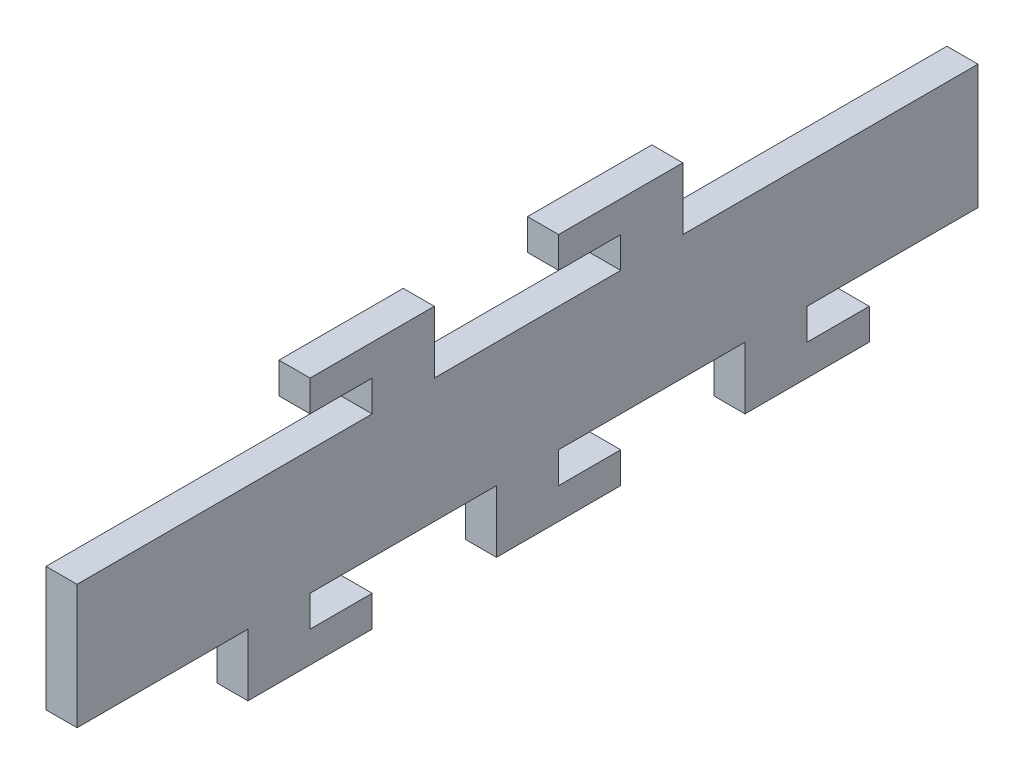
ISO-10303-21;
HEADER;
FILE_DESCRIPTION(('STEP AP214'),'2;1');
FILE_NAME('part.step','',(''),(''),'','','');
FILE_SCHEMA(('AUTOMOTIVE_DESIGN { 1 0 10303 214 1 1 1 1 }'));
ENDSEC;
DATA;
#1=APPLICATION_CONTEXT('core data for automotive mechanical design processes');
#2=APPLICATION_PROTOCOL_DEFINITION('international standard','automotive_design',2000,#1);
#3=PRODUCT_CONTEXT('',#1,'mechanical');
#4=PRODUCT('Part','Part','',(#3));
#5=PRODUCT_RELATED_PRODUCT_CATEGORY('part','',(#4));
#6=PRODUCT_DEFINITION_FORMATION('','',#4);
#7=PRODUCT_DEFINITION_CONTEXT('part definition',#1,'design');
#8=PRODUCT_DEFINITION('design','',#6,#7);
#9=PRODUCT_DEFINITION_SHAPE('','',#8);
#10=(LENGTH_UNIT() NAMED_UNIT(*) SI_UNIT(.MILLI.,.METRE.));
#11=(NAMED_UNIT(*) PLANE_ANGLE_UNIT() SI_UNIT($,.RADIAN.));
#12=(NAMED_UNIT(*) SI_UNIT($,.STERADIAN.) SOLID_ANGLE_UNIT());
#13=UNCERTAINTY_MEASURE_WITH_UNIT(LENGTH_MEASURE(1.E-05),#10,'distance_accuracy_value','');
#14=(GEOMETRIC_REPRESENTATION_CONTEXT(3) GLOBAL_UNCERTAINTY_ASSIGNED_CONTEXT((#13)) GLOBAL_UNIT_ASSIGNED_CONTEXT((#10,
#11,#12)) REPRESENTATION_CONTEXT('',''));
#15=CARTESIAN_POINT('',(0.,0.,0.));
#16=DIRECTION('',(0.,0.,1.));
#17=DIRECTION('',(1.,0.,0.));
#18=AXIS2_PLACEMENT_3D('',#15,#16,#17);
#19=CARTESIAN_POINT('',(5.,10.,72.5));
#20=DIRECTION('',(0.,-1.,0.));
#21=DIRECTION('',(0.,0.,-1.));
#22=AXIS2_PLACEMENT_3D('',#19,#20,#21);
#23=PLANE('',#22);
#24=DIRECTION('',(0.,0.,1.));
#25=VECTOR('',#24,1.);
#26=CARTESIAN_POINT('',(0.,10.,72.5));
#27=LINE('',#26,#25);
#28=CARTESIAN_POINT('',(0.,10.,25.));
#29=VERTEX_POINT('',#28);
#30=CARTESIAN_POINT('',(0.,10.,72.5));
#31=VERTEX_POINT('',#30);
#32=EDGE_CURVE('E285',#29,#31,#27,.T.);
#33=ORIENTED_EDGE('',*,*,#32,.T.);
#34=DIRECTION('',(-1.,0.,0.));
#35=VECTOR('',#34,1.);
#36=CARTESIAN_POINT('',(5.,10.,72.5));
#37=LINE('',#36,#35);
#38=CARTESIAN_POINT('',(5.,10.,72.5));
#39=VERTEX_POINT('',#38);
#40=EDGE_CURVE('E11',#39,#31,#37,.T.);
#41=ORIENTED_EDGE('',*,*,#40,.F.);
#42=DIRECTION('',(0.,0.,1.));
#43=VECTOR('',#42,1.);
#44=CARTESIAN_POINT('',(5.,10.,72.5));
#45=LINE('',#44,#43);
#46=CARTESIAN_POINT('',(5.,10.,25.));
#47=VERTEX_POINT('',#46);
#48=EDGE_CURVE('E351',#47,#39,#45,.T.);
#49=ORIENTED_EDGE('',*,*,#48,.F.);
#50=DIRECTION('',(-1.,0.,0.));
#51=VECTOR('',#50,1.);
#52=CARTESIAN_POINT('',(5.,10.,25.));
#53=LINE('',#52,#51);
#54=EDGE_CURVE('E281',#47,#29,#53,.T.);
#55=ORIENTED_EDGE('',*,*,#54,.T.);
#56=EDGE_LOOP('',(#33,#41,#49,#55));
#57=FACE_BOUND('',#56,.T.);
#58=ADVANCED_FACE('F33',(#57),#23,.F.);
#59=CARTESIAN_POINT('',(5.,10.,72.5));
#60=DIRECTION('',(0.,0.,-1.));
#61=DIRECTION('',(0.,1.,0.));
#62=AXIS2_PLACEMENT_3D('',#59,#60,#61);
#63=PLANE('',#62);
#64=DIRECTION('',(0.,-1.,0.));
#65=VECTOR('',#64,1.);
#66=CARTESIAN_POINT('',(0.,10.,72.5));
#67=LINE('',#66,#65);
#68=CARTESIAN_POINT('',(0.,-10.,72.5));
#69=VERTEX_POINT('',#68);
#70=EDGE_CURVE('E288',#31,#69,#67,.T.);
#71=ORIENTED_EDGE('',*,*,#70,.T.);
#72=DIRECTION('',(-1.,0.,0.));
#73=VECTOR('',#72,1.);
#74=CARTESIAN_POINT('',(5.,-10.,72.5));
#75=LINE('',#74,#73);
#76=CARTESIAN_POINT('',(5.,-10.,72.5));
#77=VERTEX_POINT('',#76);
#78=EDGE_CURVE('E41',#77,#69,#75,.T.);
#79=ORIENTED_EDGE('',*,*,#78,.F.);
#80=DIRECTION('',(0.,-1.,0.));
#81=VECTOR('',#80,1.);
#82=CARTESIAN_POINT('',(5.,10.,72.5));
#83=LINE('',#82,#81);
#84=EDGE_CURVE('E170',#39,#77,#83,.T.);
#85=ORIENTED_EDGE('',*,*,#84,.F.);
#86=ORIENTED_EDGE('',*,*,#40,.T.);
#87=EDGE_LOOP('',(#71,#79,#85,#86));
#88=FACE_BOUND('',#87,.T.);
#89=ADVANCED_FACE('F539',(#88),#63,.F.);
#90=CARTESIAN_POINT('',(5.,-10.,72.5));
#91=DIRECTION('',(0.,1.,0.));
#92=DIRECTION('',(0.,0.,1.));
#93=AXIS2_PLACEMENT_3D('',#90,#91,#92);
#94=PLANE('',#93);
#95=DIRECTION('',(0.,0.,-1.));
#96=VECTOR('',#95,1.);
#97=CARTESIAN_POINT('',(0.,-10.,72.5));
#98=LINE('',#97,#96);
#99=CARTESIAN_POINT('',(0.,-10.,45.));
#100=VERTEX_POINT('',#99);
#101=EDGE_CURVE('E290',#69,#100,#98,.T.);
#102=ORIENTED_EDGE('',*,*,#101,.T.);
#103=DIRECTION('',(-1.,0.,0.));
#104=VECTOR('',#103,1.);
#105=CARTESIAN_POINT('',(5.,-10.,45.));
#106=LINE('',#105,#104);
#107=CARTESIAN_POINT('',(5.,-10.,45.));
#108=VERTEX_POINT('',#107);
#109=EDGE_CURVE('E436',#108,#100,#106,.T.);
#110=ORIENTED_EDGE('',*,*,#109,.F.);
#111=DIRECTION('',(0.,0.,-1.));
#112=VECTOR('',#111,1.);
#113=CARTESIAN_POINT('',(5.,-10.,72.5));
#114=LINE('',#113,#112);
#115=EDGE_CURVE('E444',#77,#108,#114,.T.);
#116=ORIENTED_EDGE('',*,*,#115,.F.);
#117=ORIENTED_EDGE('',*,*,#78,.T.);
#118=EDGE_LOOP('',(#102,#110,#116,#117));
#119=FACE_BOUND('',#118,.T.);
#120=ADVANCED_FACE('F442',(#119),#94,.F.);
#121=CARTESIAN_POINT('',(5.,-20.,45.));
#122=DIRECTION('',(0.,0.,-1.));
#123=DIRECTION('',(0.,1.,0.));
#124=AXIS2_PLACEMENT_3D('',#121,#122,#123);
#125=PLANE('',#124);
#126=DIRECTION('',(0.,-1.,0.));
#127=VECTOR('',#126,1.);
#128=CARTESIAN_POINT('',(0.,-20.,45.));
#129=LINE('',#128,#127);
#130=CARTESIAN_POINT('',(0.,-20.,45.));
#131=VERTEX_POINT('',#130);
#132=EDGE_CURVE('E292',#100,#131,#129,.T.);
#133=ORIENTED_EDGE('',*,*,#132,.T.);
#134=DIRECTION('',(-1.,0.,0.));
#135=VECTOR('',#134,1.);
#136=CARTESIAN_POINT('',(5.,-20.,45.));
#137=LINE('',#136,#135);
#138=CARTESIAN_POINT('',(5.,-20.,45.));
#139=VERTEX_POINT('',#138);
#140=EDGE_CURVE('E433',#139,#131,#137,.T.);
#141=ORIENTED_EDGE('',*,*,#140,.F.);
#142=DIRECTION('',(0.,-1.,0.));
#143=VECTOR('',#142,1.);
#144=CARTESIAN_POINT('',(5.,-20.,45.));
#145=LINE('',#144,#143);
#146=EDGE_CURVE('E462',#108,#139,#145,.T.);
#147=ORIENTED_EDGE('',*,*,#146,.F.);
#148=ORIENTED_EDGE('',*,*,#109,.T.);
#149=EDGE_LOOP('',(#133,#141,#147,#148));
#150=FACE_BOUND('',#149,.T.);
#151=ADVANCED_FACE('F453',(#150),#125,.F.);
#152=CARTESIAN_POINT('',(5.,-20.,25.));
#153=DIRECTION('',(0.,1.,0.));
#154=DIRECTION('',(0.,0.,1.));
#155=AXIS2_PLACEMENT_3D('',#152,#153,#154);
#156=PLANE('',#155);
#157=DIRECTION('',(0.,0.,-1.));
#158=VECTOR('',#157,1.);
#159=CARTESIAN_POINT('',(0.,-20.,25.));
#160=LINE('',#159,#158);
#161=CARTESIAN_POINT('',(0.,-20.,25.));
#162=VERTEX_POINT('',#161);
#163=EDGE_CURVE('E294',#131,#162,#160,.T.);
#164=ORIENTED_EDGE('',*,*,#163,.T.);
#165=DIRECTION('',(-1.,0.,0.));
#166=VECTOR('',#165,1.);
#167=CARTESIAN_POINT('',(5.,-20.,25.));
#168=LINE('',#167,#166);
#169=CARTESIAN_POINT('',(5.,-20.,25.));
#170=VERTEX_POINT('',#169);
#171=EDGE_CURVE('E430',#170,#162,#168,.T.);
#172=ORIENTED_EDGE('',*,*,#171,.F.);
#173=DIRECTION('',(0.,0.,-1.));
#174=VECTOR('',#173,1.);
#175=CARTESIAN_POINT('',(5.,-20.,25.));
#176=LINE('',#175,#174);
#177=EDGE_CURVE('E459',#139,#170,#176,.T.);
#178=ORIENTED_EDGE('',*,*,#177,.F.);
#179=ORIENTED_EDGE('',*,*,#140,.T.);
#180=EDGE_LOOP('',(#164,#172,#178,#179));
#181=FACE_BOUND('',#180,.T.);
#182=ADVANCED_FACE('F457',(#181),#156,.F.);
#183=CARTESIAN_POINT('',(5.,-15.,25.));
#184=DIRECTION('',(0.,0.,1.));
#185=DIRECTION('',(1.,0.,0.));
#186=AXIS2_PLACEMENT_3D('',#183,#184,#185);
#187=PLANE('',#186);
#188=DIRECTION('',(0.,1.,0.));
#189=VECTOR('',#188,1.);
#190=CARTESIAN_POINT('',(0.,-15.,25.));
#191=LINE('',#190,#189);
#192=CARTESIAN_POINT('',(0.,-15.,25.));
#193=VERTEX_POINT('',#192);
#194=EDGE_CURVE('E296',#162,#193,#191,.T.);
#195=ORIENTED_EDGE('',*,*,#194,.T.);
#196=DIRECTION('',(-1.,0.,0.));
#197=VECTOR('',#196,1.);
#198=CARTESIAN_POINT('',(5.,-15.,25.));
#199=LINE('',#198,#197);
#200=CARTESIAN_POINT('',(5.,-15.,25.));
#201=VERTEX_POINT('',#200);
#202=EDGE_CURVE('E427',#201,#193,#199,.T.);
#203=ORIENTED_EDGE('',*,*,#202,.F.);
#204=DIRECTION('',(0.,1.,0.));
#205=VECTOR('',#204,1.);
#206=CARTESIAN_POINT('',(5.,-15.,25.));
#207=LINE('',#206,#205);
#208=EDGE_CURVE('E461',#170,#201,#207,.T.);
#209=ORIENTED_EDGE('',*,*,#208,.F.);
#210=ORIENTED_EDGE('',*,*,#171,.T.);
#211=EDGE_LOOP('',(#195,#203,#209,#210));
#212=FACE_BOUND('',#211,.T.);
#213=ADVANCED_FACE('F552',(#212),#187,.F.);
#214=CARTESIAN_POINT('',(5.,-15.,35.));
#215=DIRECTION('',(0.,-1.,0.));
#216=DIRECTION('',(0.,0.,-1.));
#217=AXIS2_PLACEMENT_3D('',#214,#215,#216);
#218=PLANE('',#217);
#219=DIRECTION('',(0.,0.,1.));
#220=VECTOR('',#219,1.);
#221=CARTESIAN_POINT('',(0.,-15.,35.));
#222=LINE('',#221,#220);
#223=CARTESIAN_POINT('',(0.,-15.,35.));
#224=VERTEX_POINT('',#223);
#225=EDGE_CURVE('E298',#193,#224,#222,.T.);
#226=ORIENTED_EDGE('',*,*,#225,.T.);
#227=DIRECTION('',(-1.,0.,0.));
#228=VECTOR('',#227,1.);
#229=CARTESIAN_POINT('',(5.,-15.,35.));
#230=LINE('',#229,#228);
#231=CARTESIAN_POINT('',(5.,-15.,35.));
#232=VERTEX_POINT('',#231);
#233=EDGE_CURVE('E424',#232,#224,#230,.T.);
#234=ORIENTED_EDGE('',*,*,#233,.F.);
#235=DIRECTION('',(0.,0.,1.));
#236=VECTOR('',#235,1.);
#237=CARTESIAN_POINT('',(5.,-15.,35.));
#238=LINE('',#237,#236);
#239=EDGE_CURVE('E464',#201,#232,#238,.T.);
#240=ORIENTED_EDGE('',*,*,#239,.F.);
#241=ORIENTED_EDGE('',*,*,#202,.T.);
#242=EDGE_LOOP('',(#226,#234,#240,#241));
#243=FACE_BOUND('',#242,.T.);
#244=ADVANCED_FACE('F555',(#243),#218,.F.);
#245=CARTESIAN_POINT('',(5.,-10.,35.));
#246=DIRECTION('',(0.,0.,1.));
#247=DIRECTION('',(1.,0.,0.));
#248=AXIS2_PLACEMENT_3D('',#245,#246,#247);
#249=PLANE('',#248);
#250=DIRECTION('',(0.,1.,0.));
#251=VECTOR('',#250,1.);
#252=CARTESIAN_POINT('',(0.,-10.,35.));
#253=LINE('',#252,#251);
#254=CARTESIAN_POINT('',(0.,-10.,35.));
#255=VERTEX_POINT('',#254);
#256=EDGE_CURVE('E300',#224,#255,#253,.T.);
#257=ORIENTED_EDGE('',*,*,#256,.T.);
#258=DIRECTION('',(-1.,0.,0.));
#259=VECTOR('',#258,1.);
#260=CARTESIAN_POINT('',(5.,-10.,35.));
#261=LINE('',#260,#259);
#262=CARTESIAN_POINT('',(5.,-10.,35.));
#263=VERTEX_POINT('',#262);
#264=EDGE_CURVE('E421',#263,#255,#261,.T.);
#265=ORIENTED_EDGE('',*,*,#264,.F.);
#266=DIRECTION('',(0.,1.,0.));
#267=VECTOR('',#266,1.);
#268=CARTESIAN_POINT('',(5.,-10.,35.));
#269=LINE('',#268,#267);
#270=EDGE_CURVE('E470',#232,#263,#269,.T.);
#271=ORIENTED_EDGE('',*,*,#270,.F.);
#272=ORIENTED_EDGE('',*,*,#233,.T.);
#273=EDGE_LOOP('',(#257,#265,#271,#272));
#274=FACE_BOUND('',#273,.T.);
#275=ADVANCED_FACE('F559',(#274),#249,.F.);
#276=CARTESIAN_POINT('',(5.,-10.,5.));
#277=DIRECTION('',(0.,1.,0.));
#278=DIRECTION('',(0.,0.,1.));
#279=AXIS2_PLACEMENT_3D('',#276,#277,#278);
#280=PLANE('',#279);
#281=DIRECTION('',(0.,0.,-1.));
#282=VECTOR('',#281,1.);
#283=CARTESIAN_POINT('',(0.,-10.,5.));
#284=LINE('',#283,#282);
#285=CARTESIAN_POINT('',(0.,-10.,5.));
#286=VERTEX_POINT('',#285);
#287=EDGE_CURVE('E302',#255,#286,#284,.T.);
#288=ORIENTED_EDGE('',*,*,#287,.T.);
#289=DIRECTION('',(-1.,0.,0.));
#290=VECTOR('',#289,1.);
#291=CARTESIAN_POINT('',(5.,-10.,5.));
#292=LINE('',#291,#290);
#293=CARTESIAN_POINT('',(5.,-10.,5.));
#294=VERTEX_POINT('',#293);
#295=EDGE_CURVE('E418',#294,#286,#292,.T.);
#296=ORIENTED_EDGE('',*,*,#295,.F.);
#297=DIRECTION('',(0.,0.,-1.));
#298=VECTOR('',#297,1.);
#299=CARTESIAN_POINT('',(5.,-10.,5.));
#300=LINE('',#299,#298);
#301=EDGE_CURVE('E472',#263,#294,#300,.T.);
#302=ORIENTED_EDGE('',*,*,#301,.F.);
#303=ORIENTED_EDGE('',*,*,#264,.T.);
#304=EDGE_LOOP('',(#288,#296,#302,#303));
#305=FACE_BOUND('',#304,.T.);
#306=ADVANCED_FACE('F563',(#305),#280,.F.);
#307=CARTESIAN_POINT('',(5.,-20.,5.));
#308=DIRECTION('',(0.,0.,-1.));
#309=DIRECTION('',(-1.,0.,0.));
#310=AXIS2_PLACEMENT_3D('',#307,#308,#309);
#311=PLANE('',#310);
#312=DIRECTION('',(0.,-1.,0.));
#313=VECTOR('',#312,1.);
#314=CARTESIAN_POINT('',(0.,-20.,5.));
#315=LINE('',#314,#313);
#316=CARTESIAN_POINT('',(0.,-20.,5.));
#317=VERTEX_POINT('',#316);
#318=EDGE_CURVE('E304',#286,#317,#315,.T.);
#319=ORIENTED_EDGE('',*,*,#318,.T.);
#320=DIRECTION('',(-1.,0.,0.));
#321=VECTOR('',#320,1.);
#322=CARTESIAN_POINT('',(5.,-20.,5.));
#323=LINE('',#322,#321);
#324=CARTESIAN_POINT('',(5.,-20.,5.));
#325=VERTEX_POINT('',#324);
#326=EDGE_CURVE('E415',#325,#317,#323,.T.);
#327=ORIENTED_EDGE('',*,*,#326,.F.);
#328=DIRECTION('',(0.,-1.,0.));
#329=VECTOR('',#328,1.);
#330=CARTESIAN_POINT('',(5.,-20.,5.));
#331=LINE('',#330,#329);
#332=EDGE_CURVE('E474',#294,#325,#331,.T.);
#333=ORIENTED_EDGE('',*,*,#332,.F.);
#334=ORIENTED_EDGE('',*,*,#295,.T.);
#335=EDGE_LOOP('',(#319,#327,#333,#334));
#336=FACE_BOUND('',#335,.T.);
#337=ADVANCED_FACE('F567',(#336),#311,.F.);
#338=CARTESIAN_POINT('',(5.,-20.,-15.));
#339=DIRECTION('',(0.,1.,0.));
#340=DIRECTION('',(0.,0.,1.));
#341=AXIS2_PLACEMENT_3D('',#338,#339,#340);
#342=PLANE('',#341);
#343=DIRECTION('',(0.,0.,-1.));
#344=VECTOR('',#343,1.);
#345=CARTESIAN_POINT('',(0.,-20.,-15.));
#346=LINE('',#345,#344);
#347=CARTESIAN_POINT('',(0.,-20.,-15.));
#348=VERTEX_POINT('',#347);
#349=EDGE_CURVE('E306',#317,#348,#346,.T.);
#350=ORIENTED_EDGE('',*,*,#349,.T.);
#351=DIRECTION('',(-1.,0.,0.));
#352=VECTOR('',#351,1.);
#353=CARTESIAN_POINT('',(5.,-20.,-15.));
#354=LINE('',#353,#352);
#355=CARTESIAN_POINT('',(5.,-20.,-15.));
#356=VERTEX_POINT('',#355);
#357=EDGE_CURVE('E412',#356,#348,#354,.T.);
#358=ORIENTED_EDGE('',*,*,#357,.F.);
#359=DIRECTION('',(0.,0.,-1.));
#360=VECTOR('',#359,1.);
#361=CARTESIAN_POINT('',(5.,-20.,-15.));
#362=LINE('',#361,#360);
#363=EDGE_CURVE('E476',#325,#356,#362,.T.);
#364=ORIENTED_EDGE('',*,*,#363,.F.);
#365=ORIENTED_EDGE('',*,*,#326,.T.);
#366=EDGE_LOOP('',(#350,#358,#364,#365));
#367=FACE_BOUND('',#366,.T.);
#368=ADVANCED_FACE('F571',(#367),#342,.F.);
#369=CARTESIAN_POINT('',(5.,-15.,-15.));
#370=DIRECTION('',(0.,0.,1.));
#371=DIRECTION('',(1.,0.,0.));
#372=AXIS2_PLACEMENT_3D('',#369,#370,#371);
#373=PLANE('',#372);
#374=DIRECTION('',(0.,1.,0.));
#375=VECTOR('',#374,1.);
#376=CARTESIAN_POINT('',(0.,-15.,-15.));
#377=LINE('',#376,#375);
#378=CARTESIAN_POINT('',(0.,-15.,-15.));
#379=VERTEX_POINT('',#378);
#380=EDGE_CURVE('E308',#348,#379,#377,.T.);
#381=ORIENTED_EDGE('',*,*,#380,.T.);
#382=DIRECTION('',(-1.,0.,0.));
#383=VECTOR('',#382,1.);
#384=CARTESIAN_POINT('',(5.,-15.,-15.));
#385=LINE('',#384,#383);
#386=CARTESIAN_POINT('',(5.,-15.,-15.));
#387=VERTEX_POINT('',#386);
#388=EDGE_CURVE('E409',#387,#379,#385,.T.);
#389=ORIENTED_EDGE('',*,*,#388,.F.);
#390=DIRECTION('',(0.,1.,0.));
#391=VECTOR('',#390,1.);
#392=CARTESIAN_POINT('',(5.,-15.,-15.));
#393=LINE('',#392,#391);
#394=EDGE_CURVE('E478',#356,#387,#393,.T.);
#395=ORIENTED_EDGE('',*,*,#394,.F.);
#396=ORIENTED_EDGE('',*,*,#357,.T.);
#397=EDGE_LOOP('',(#381,#389,#395,#396));
#398=FACE_BOUND('',#397,.T.);
#399=ADVANCED_FACE('F575',(#398),#373,.F.);
#400=CARTESIAN_POINT('',(5.,-15.,-5.));
#401=DIRECTION('',(0.,-1.,0.));
#402=DIRECTION('',(0.,0.,-1.));
#403=AXIS2_PLACEMENT_3D('',#400,#401,#402);
#404=PLANE('',#403);
#405=DIRECTION('',(0.,0.,1.));
#406=VECTOR('',#405,1.);
#407=CARTESIAN_POINT('',(0.,-15.,-5.));
#408=LINE('',#407,#406);
#409=CARTESIAN_POINT('',(0.,-15.,-5.));
#410=VERTEX_POINT('',#409);
#411=EDGE_CURVE('E310',#379,#410,#408,.T.);
#412=ORIENTED_EDGE('',*,*,#411,.T.);
#413=DIRECTION('',(-1.,0.,0.));
#414=VECTOR('',#413,1.);
#415=CARTESIAN_POINT('',(5.,-15.,-5.));
#416=LINE('',#415,#414);
#417=CARTESIAN_POINT('',(5.,-15.,-5.));
#418=VERTEX_POINT('',#417);
#419=EDGE_CURVE('E406',#418,#410,#416,.T.);
#420=ORIENTED_EDGE('',*,*,#419,.F.);
#421=DIRECTION('',(0.,0.,1.));
#422=VECTOR('',#421,1.);
#423=CARTESIAN_POINT('',(5.,-15.,-5.));
#424=LINE('',#423,#422);
#425=EDGE_CURVE('E480',#387,#418,#424,.T.);
#426=ORIENTED_EDGE('',*,*,#425,.F.);
#427=ORIENTED_EDGE('',*,*,#388,.T.);
#428=EDGE_LOOP('',(#412,#420,#426,#427));
#429=FACE_BOUND('',#428,.T.);
#430=ADVANCED_FACE('F579',(#429),#404,.F.);
#431=CARTESIAN_POINT('',(5.,-10.,-5.));
#432=DIRECTION('',(0.,0.,1.));
#433=DIRECTION('',(0.,-1.,0.));
#434=AXIS2_PLACEMENT_3D('',#431,#432,#433);
#435=PLANE('',#434);
#436=DIRECTION('',(0.,1.,0.));
#437=VECTOR('',#436,1.);
#438=CARTESIAN_POINT('',(0.,-10.,-5.));
#439=LINE('',#438,#437);
#440=CARTESIAN_POINT('',(0.,-10.,-5.));
#441=VERTEX_POINT('',#440);
#442=EDGE_CURVE('E312',#410,#441,#439,.T.);
#443=ORIENTED_EDGE('',*,*,#442,.T.);
#444=DIRECTION('',(-1.,0.,0.));
#445=VECTOR('',#444,1.);
#446=CARTESIAN_POINT('',(5.,-10.,-5.));
#447=LINE('',#446,#445);
#448=CARTESIAN_POINT('',(5.,-10.,-5.));
#449=VERTEX_POINT('',#448);
#450=EDGE_CURVE('E403',#449,#441,#447,.T.);
#451=ORIENTED_EDGE('',*,*,#450,.F.);
#452=DIRECTION('',(0.,1.,0.));
#453=VECTOR('',#452,1.);
#454=CARTESIAN_POINT('',(5.,-10.,-5.));
#455=LINE('',#454,#453);
#456=EDGE_CURVE('E482',#418,#449,#455,.T.);
#457=ORIENTED_EDGE('',*,*,#456,.F.);
#458=ORIENTED_EDGE('',*,*,#419,.T.);
#459=EDGE_LOOP('',(#443,#451,#457,#458));
#460=FACE_BOUND('',#459,.T.);
#461=ADVANCED_FACE('F583',(#460),#435,.F.);
#462=CARTESIAN_POINT('',(5.,-10.,-35.));
#463=DIRECTION('',(0.,1.,0.));
#464=DIRECTION('',(0.,0.,1.));
#465=AXIS2_PLACEMENT_3D('',#462,#463,#464);
#466=PLANE('',#465);
#467=DIRECTION('',(0.,0.,-1.));
#468=VECTOR('',#467,1.);
#469=CARTESIAN_POINT('',(0.,-10.,-35.));
#470=LINE('',#469,#468);
#471=CARTESIAN_POINT('',(0.,-10.,-35.));
#472=VERTEX_POINT('',#471);
#473=EDGE_CURVE('E314',#441,#472,#470,.T.);
#474=ORIENTED_EDGE('',*,*,#473,.T.);
#475=DIRECTION('',(-1.,0.,0.));
#476=VECTOR('',#475,1.);
#477=CARTESIAN_POINT('',(5.,-10.,-35.));
#478=LINE('',#477,#476);
#479=CARTESIAN_POINT('',(5.,-10.,-35.));
#480=VERTEX_POINT('',#479);
#481=EDGE_CURVE('E400',#480,#472,#478,.T.);
#482=ORIENTED_EDGE('',*,*,#481,.F.);
#483=DIRECTION('',(0.,0.,-1.));
#484=VECTOR('',#483,1.);
#485=CARTESIAN_POINT('',(5.,-10.,-35.));
#486=LINE('',#485,#484);
#487=EDGE_CURVE('E484',#449,#480,#486,.T.);
#488=ORIENTED_EDGE('',*,*,#487,.F.);
#489=ORIENTED_EDGE('',*,*,#450,.T.);
#490=EDGE_LOOP('',(#474,#482,#488,#489));
#491=FACE_BOUND('',#490,.T.);
#492=ADVANCED_FACE('F587',(#491),#466,.F.);
#493=CARTESIAN_POINT('',(5.,-20.,-35.));
#494=DIRECTION('',(0.,0.,-1.));
#495=DIRECTION('',(0.,1.,0.));
#496=AXIS2_PLACEMENT_3D('',#493,#494,#495);
#497=PLANE('',#496);
#498=DIRECTION('',(0.,-1.,0.));
#499=VECTOR('',#498,1.);
#500=CARTESIAN_POINT('',(0.,-20.,-35.));
#501=LINE('',#500,#499);
#502=CARTESIAN_POINT('',(0.,-20.,-35.));
#503=VERTEX_POINT('',#502);
#504=EDGE_CURVE('E316',#472,#503,#501,.T.);
#505=ORIENTED_EDGE('',*,*,#504,.T.);
#506=DIRECTION('',(-1.,0.,0.));
#507=VECTOR('',#506,1.);
#508=CARTESIAN_POINT('',(5.,-20.,-35.));
#509=LINE('',#508,#507);
#510=CARTESIAN_POINT('',(5.,-20.,-35.));
#511=VERTEX_POINT('',#510);
#512=EDGE_CURVE('E397',#511,#503,#509,.T.);
#513=ORIENTED_EDGE('',*,*,#512,.F.);
#514=DIRECTION('',(0.,-1.,0.));
#515=VECTOR('',#514,1.);
#516=CARTESIAN_POINT('',(5.,-20.,-35.));
#517=LINE('',#516,#515);
#518=EDGE_CURVE('E486',#480,#511,#517,.T.);
#519=ORIENTED_EDGE('',*,*,#518,.F.);
#520=ORIENTED_EDGE('',*,*,#481,.T.);
#521=EDGE_LOOP('',(#505,#513,#519,#520));
#522=FACE_BOUND('',#521,.T.);
#523=ADVANCED_FACE('F591',(#522),#497,.F.);
#524=CARTESIAN_POINT('',(5.,-20.,-55.));
#525=DIRECTION('',(0.,1.,0.));
#526=DIRECTION('',(0.,0.,1.));
#527=AXIS2_PLACEMENT_3D('',#524,#525,#526);
#528=PLANE('',#527);
#529=DIRECTION('',(0.,0.,-1.));
#530=VECTOR('',#529,1.);
#531=CARTESIAN_POINT('',(0.,-20.,-55.));
#532=LINE('',#531,#530);
#533=CARTESIAN_POINT('',(0.,-20.,-55.));
#534=VERTEX_POINT('',#533);
#535=EDGE_CURVE('E318',#503,#534,#532,.T.);
#536=ORIENTED_EDGE('',*,*,#535,.T.);
#537=DIRECTION('',(-1.,0.,0.));
#538=VECTOR('',#537,1.);
#539=CARTESIAN_POINT('',(5.,-20.,-55.));
#540=LINE('',#539,#538);
#541=CARTESIAN_POINT('',(5.,-20.,-55.));
#542=VERTEX_POINT('',#541);
#543=EDGE_CURVE('E394',#542,#534,#540,.T.);
#544=ORIENTED_EDGE('',*,*,#543,.F.);
#545=DIRECTION('',(0.,0.,-1.));
#546=VECTOR('',#545,1.);
#547=CARTESIAN_POINT('',(5.,-20.,-55.));
#548=LINE('',#547,#546);
#549=EDGE_CURVE('E488',#511,#542,#548,.T.);
#550=ORIENTED_EDGE('',*,*,#549,.F.);
#551=ORIENTED_EDGE('',*,*,#512,.T.);
#552=EDGE_LOOP('',(#536,#544,#550,#551));
#553=FACE_BOUND('',#552,.T.);
#554=ADVANCED_FACE('F595',(#553),#528,.F.);
#555=CARTESIAN_POINT('',(5.,-15.,-55.));
#556=DIRECTION('',(0.,0.,1.));
#557=DIRECTION('',(1.,0.,0.));
#558=AXIS2_PLACEMENT_3D('',#555,#556,#557);
#559=PLANE('',#558);
#560=DIRECTION('',(0.,1.,0.));
#561=VECTOR('',#560,1.);
#562=CARTESIAN_POINT('',(0.,-15.,-55.));
#563=LINE('',#562,#561);
#564=CARTESIAN_POINT('',(0.,-15.,-55.));
#565=VERTEX_POINT('',#564);
#566=EDGE_CURVE('E320',#534,#565,#563,.T.);
#567=ORIENTED_EDGE('',*,*,#566,.T.);
#568=DIRECTION('',(-1.,0.,0.));
#569=VECTOR('',#568,1.);
#570=CARTESIAN_POINT('',(5.,-15.,-55.));
#571=LINE('',#570,#569);
#572=CARTESIAN_POINT('',(5.,-15.,-55.));
#573=VERTEX_POINT('',#572);
#574=EDGE_CURVE('E391',#573,#565,#571,.T.);
#575=ORIENTED_EDGE('',*,*,#574,.F.);
#576=DIRECTION('',(0.,1.,0.));
#577=VECTOR('',#576,1.);
#578=CARTESIAN_POINT('',(5.,-15.,-55.));
#579=LINE('',#578,#577);
#580=EDGE_CURVE('E490',#542,#573,#579,.T.);
#581=ORIENTED_EDGE('',*,*,#580,.F.);
#582=ORIENTED_EDGE('',*,*,#543,.T.);
#583=EDGE_LOOP('',(#567,#575,#581,#582));
#584=FACE_BOUND('',#583,.T.);
#585=ADVANCED_FACE('F599',(#584),#559,.F.);
#586=CARTESIAN_POINT('',(5.,-15.,-45.));
#587=DIRECTION('',(0.,-1.,0.));
#588=DIRECTION('',(0.,0.,-1.));
#589=AXIS2_PLACEMENT_3D('',#586,#587,#588);
#590=PLANE('',#589);
#591=DIRECTION('',(0.,0.,1.));
#592=VECTOR('',#591,1.);
#593=CARTESIAN_POINT('',(0.,-15.,-45.));
#594=LINE('',#593,#592);
#595=CARTESIAN_POINT('',(0.,-15.,-45.));
#596=VERTEX_POINT('',#595);
#597=EDGE_CURVE('E322',#565,#596,#594,.T.);
#598=ORIENTED_EDGE('',*,*,#597,.T.);
#599=DIRECTION('',(-1.,0.,0.));
#600=VECTOR('',#599,1.);
#601=CARTESIAN_POINT('',(5.,-15.,-45.));
#602=LINE('',#601,#600);
#603=CARTESIAN_POINT('',(5.,-15.,-45.));
#604=VERTEX_POINT('',#603);
#605=EDGE_CURVE('E388',#604,#596,#602,.T.);
#606=ORIENTED_EDGE('',*,*,#605,.F.);
#607=DIRECTION('',(0.,0.,1.));
#608=VECTOR('',#607,1.);
#609=CARTESIAN_POINT('',(5.,-15.,-45.));
#610=LINE('',#609,#608);
#611=EDGE_CURVE('E492',#573,#604,#610,.T.);
#612=ORIENTED_EDGE('',*,*,#611,.F.);
#613=ORIENTED_EDGE('',*,*,#574,.T.);
#614=EDGE_LOOP('',(#598,#606,#612,#613));
#615=FACE_BOUND('',#614,.T.);
#616=ADVANCED_FACE('F603',(#615),#590,.F.);
#617=CARTESIAN_POINT('',(5.,-10.,-45.));
#618=DIRECTION('',(0.,0.,1.));
#619=DIRECTION('',(0.,-1.,0.));
#620=AXIS2_PLACEMENT_3D('',#617,#618,#619);
#621=PLANE('',#620);
#622=DIRECTION('',(0.,1.,0.));
#623=VECTOR('',#622,1.);
#624=CARTESIAN_POINT('',(0.,-10.,-45.));
#625=LINE('',#624,#623);
#626=CARTESIAN_POINT('',(0.,-10.,-45.));
#627=VERTEX_POINT('',#626);
#628=EDGE_CURVE('E324',#596,#627,#625,.T.);
#629=ORIENTED_EDGE('',*,*,#628,.T.);
#630=DIRECTION('',(-1.,0.,0.));
#631=VECTOR('',#630,1.);
#632=CARTESIAN_POINT('',(5.,-10.,-45.));
#633=LINE('',#632,#631);
#634=CARTESIAN_POINT('',(5.,-10.,-45.));
#635=VERTEX_POINT('',#634);
#636=EDGE_CURVE('E385',#635,#627,#633,.T.);
#637=ORIENTED_EDGE('',*,*,#636,.F.);
#638=DIRECTION('',(0.,1.,0.));
#639=VECTOR('',#638,1.);
#640=CARTESIAN_POINT('',(5.,-10.,-45.));
#641=LINE('',#640,#639);
#642=EDGE_CURVE('E494',#604,#635,#641,.T.);
#643=ORIENTED_EDGE('',*,*,#642,.F.);
#644=ORIENTED_EDGE('',*,*,#605,.T.);
#645=EDGE_LOOP('',(#629,#637,#643,#644));
#646=FACE_BOUND('',#645,.T.);
#647=ADVANCED_FACE('F607',(#646),#621,.F.);
#648=CARTESIAN_POINT('',(5.,-10.,-72.5));
#649=DIRECTION('',(0.,1.,0.));
#650=DIRECTION('',(0.,0.,1.));
#651=AXIS2_PLACEMENT_3D('',#648,#649,#650);
#652=PLANE('',#651);
#653=DIRECTION('',(0.,0.,-1.));
#654=VECTOR('',#653,1.);
#655=CARTESIAN_POINT('',(0.,-10.,-72.5));
#656=LINE('',#655,#654);
#657=CARTESIAN_POINT('',(0.,-10.,-72.5));
#658=VERTEX_POINT('',#657);
#659=EDGE_CURVE('E326',#627,#658,#656,.T.);
#660=ORIENTED_EDGE('',*,*,#659,.T.);
#661=DIRECTION('',(-1.,0.,0.));
#662=VECTOR('',#661,1.);
#663=CARTESIAN_POINT('',(5.,-10.,-72.5));
#664=LINE('',#663,#662);
#665=CARTESIAN_POINT('',(5.,-10.,-72.5));
#666=VERTEX_POINT('',#665);
#667=EDGE_CURVE('E382',#666,#658,#664,.T.);
#668=ORIENTED_EDGE('',*,*,#667,.F.);
#669=DIRECTION('',(0.,0.,-1.));
#670=VECTOR('',#669,1.);
#671=CARTESIAN_POINT('',(5.,-10.,-72.5));
#672=LINE('',#671,#670);
#673=EDGE_CURVE('E496',#635,#666,#672,.T.);
#674=ORIENTED_EDGE('',*,*,#673,.F.);
#675=ORIENTED_EDGE('',*,*,#636,.T.);
#676=EDGE_LOOP('',(#660,#668,#674,#675));
#677=FACE_BOUND('',#676,.T.);
#678=ADVANCED_FACE('F611',(#677),#652,.F.);
#679=CARTESIAN_POINT('',(5.,10.,-72.5));
#680=DIRECTION('',(0.,0.,1.));
#681=DIRECTION('',(0.,-1.,0.));
#682=AXIS2_PLACEMENT_3D('',#679,#680,#681);
#683=PLANE('',#682);
#684=DIRECTION('',(0.,1.,0.));
#685=VECTOR('',#684,1.);
#686=CARTESIAN_POINT('',(0.,10.,-72.5));
#687=LINE('',#686,#685);
#688=CARTESIAN_POINT('',(0.,10.,-72.5));
#689=VERTEX_POINT('',#688);
#690=EDGE_CURVE('E328',#658,#689,#687,.T.);
#691=ORIENTED_EDGE('',*,*,#690,.T.);
#692=DIRECTION('',(-1.,0.,0.));
#693=VECTOR('',#692,1.);
#694=CARTESIAN_POINT('',(5.,10.,-72.5));
#695=LINE('',#694,#693);
#696=CARTESIAN_POINT('',(5.,10.,-72.5));
#697=VERTEX_POINT('',#696);
#698=EDGE_CURVE('E379',#697,#689,#695,.T.);
#699=ORIENTED_EDGE('',*,*,#698,.F.);
#700=DIRECTION('',(0.,1.,0.));
#701=VECTOR('',#700,1.);
#702=CARTESIAN_POINT('',(5.,10.,-72.5));
#703=LINE('',#702,#701);
#704=EDGE_CURVE('E498',#666,#697,#703,.T.);
#705=ORIENTED_EDGE('',*,*,#704,.F.);
#706=ORIENTED_EDGE('',*,*,#667,.T.);
#707=EDGE_LOOP('',(#691,#699,#705,#706));
#708=FACE_BOUND('',#707,.T.);
#709=ADVANCED_FACE('F615',(#708),#683,.F.);
#710=CARTESIAN_POINT('',(5.,10.,-25.));
#711=DIRECTION('',(0.,-1.,0.));
#712=DIRECTION('',(0.,0.,-1.));
#713=AXIS2_PLACEMENT_3D('',#710,#711,#712);
#714=PLANE('',#713);
#715=DIRECTION('',(0.,0.,1.));
#716=VECTOR('',#715,1.);
#717=CARTESIAN_POINT('',(0.,10.,-25.));
#718=LINE('',#717,#716);
#719=CARTESIAN_POINT('',(0.,10.,-25.));
#720=VERTEX_POINT('',#719);
#721=EDGE_CURVE('E330',#689,#720,#718,.T.);
#722=ORIENTED_EDGE('',*,*,#721,.T.);
#723=DIRECTION('',(-1.,0.,0.));
#724=VECTOR('',#723,1.);
#725=CARTESIAN_POINT('',(5.,10.,-25.));
#726=LINE('',#725,#724);
#727=CARTESIAN_POINT('',(5.,10.,-25.));
#728=VERTEX_POINT('',#727);
#729=EDGE_CURVE('E376',#728,#720,#726,.T.);
#730=ORIENTED_EDGE('',*,*,#729,.F.);
#731=DIRECTION('',(0.,0.,1.));
#732=VECTOR('',#731,1.);
#733=CARTESIAN_POINT('',(5.,10.,-25.));
#734=LINE('',#733,#732);
#735=EDGE_CURVE('E500',#697,#728,#734,.T.);
#736=ORIENTED_EDGE('',*,*,#735,.F.);
#737=ORIENTED_EDGE('',*,*,#698,.T.);
#738=EDGE_LOOP('',(#722,#730,#736,#737));
#739=FACE_BOUND('',#738,.T.);
#740=ADVANCED_FACE('F619',(#739),#714,.F.);
#741=CARTESIAN_POINT('',(5.,20.,-25.));
#742=DIRECTION('',(0.,0.,1.));
#743=DIRECTION('',(1.,0.,0.));
#744=AXIS2_PLACEMENT_3D('',#741,#742,#743);
#745=PLANE('',#744);
#746=DIRECTION('',(0.,1.,0.));
#747=VECTOR('',#746,1.);
#748=CARTESIAN_POINT('',(0.,20.,-25.));
#749=LINE('',#748,#747);
#750=CARTESIAN_POINT('',(0.,20.,-25.));
#751=VERTEX_POINT('',#750);
#752=EDGE_CURVE('E332',#720,#751,#749,.T.);
#753=ORIENTED_EDGE('',*,*,#752,.T.);
#754=DIRECTION('',(-1.,0.,0.));
#755=VECTOR('',#754,1.);
#756=CARTESIAN_POINT('',(5.,20.,-25.));
#757=LINE('',#756,#755);
#758=CARTESIAN_POINT('',(5.,20.,-25.));
#759=VERTEX_POINT('',#758);
#760=EDGE_CURVE('E373',#759,#751,#757,.T.);
#761=ORIENTED_EDGE('',*,*,#760,.F.);
#762=DIRECTION('',(0.,1.,0.));
#763=VECTOR('',#762,1.);
#764=CARTESIAN_POINT('',(5.,20.,-25.));
#765=LINE('',#764,#763);
#766=EDGE_CURVE('E502',#728,#759,#765,.T.);
#767=ORIENTED_EDGE('',*,*,#766,.F.);
#768=ORIENTED_EDGE('',*,*,#729,.T.);
#769=EDGE_LOOP('',(#753,#761,#767,#768));
#770=FACE_BOUND('',#769,.T.);
#771=ADVANCED_FACE('F623',(#770),#745,.F.);
#772=CARTESIAN_POINT('',(5.,20.,-5.));
#773=DIRECTION('',(0.,-1.,0.));
#774=DIRECTION('',(0.,0.,-1.));
#775=AXIS2_PLACEMENT_3D('',#772,#773,#774);
#776=PLANE('',#775);
#777=DIRECTION('',(0.,0.,1.));
#778=VECTOR('',#777,1.);
#779=CARTESIAN_POINT('',(0.,20.,-5.));
#780=LINE('',#779,#778);
#781=CARTESIAN_POINT('',(0.,20.,-5.));
#782=VERTEX_POINT('',#781);
#783=EDGE_CURVE('E334',#751,#782,#780,.T.);
#784=ORIENTED_EDGE('',*,*,#783,.T.);
#785=DIRECTION('',(-1.,0.,0.));
#786=VECTOR('',#785,1.);
#787=CARTESIAN_POINT('',(5.,20.,-5.));
#788=LINE('',#787,#786);
#789=CARTESIAN_POINT('',(5.,20.,-5.));
#790=VERTEX_POINT('',#789);
#791=EDGE_CURVE('E370',#790,#782,#788,.T.);
#792=ORIENTED_EDGE('',*,*,#791,.F.);
#793=DIRECTION('',(0.,0.,1.));
#794=VECTOR('',#793,1.);
#795=CARTESIAN_POINT('',(5.,20.,-5.));
#796=LINE('',#795,#794);
#797=EDGE_CURVE('E504',#759,#790,#796,.T.);
#798=ORIENTED_EDGE('',*,*,#797,.F.);
#799=ORIENTED_EDGE('',*,*,#760,.T.);
#800=EDGE_LOOP('',(#784,#792,#798,#799));
#801=FACE_BOUND('',#800,.T.);
#802=ADVANCED_FACE('F627',(#801),#776,.F.);
#803=CARTESIAN_POINT('',(5.,15.,-5.));
#804=DIRECTION('',(0.,0.,-1.));
#805=DIRECTION('',(-1.,0.,0.));
#806=AXIS2_PLACEMENT_3D('',#803,#804,#805);
#807=PLANE('',#806);
#808=DIRECTION('',(0.,-1.,0.));
#809=VECTOR('',#808,1.);
#810=CARTESIAN_POINT('',(0.,15.,-5.));
#811=LINE('',#810,#809);
#812=CARTESIAN_POINT('',(0.,15.,-5.));
#813=VERTEX_POINT('',#812);
#814=EDGE_CURVE('E336',#782,#813,#811,.T.);
#815=ORIENTED_EDGE('',*,*,#814,.T.);
#816=DIRECTION('',(-1.,0.,0.));
#817=VECTOR('',#816,1.);
#818=CARTESIAN_POINT('',(5.,15.,-5.));
#819=LINE('',#818,#817);
#820=CARTESIAN_POINT('',(5.,15.,-5.));
#821=VERTEX_POINT('',#820);
#822=EDGE_CURVE('E367',#821,#813,#819,.T.);
#823=ORIENTED_EDGE('',*,*,#822,.F.);
#824=DIRECTION('',(0.,-1.,0.));
#825=VECTOR('',#824,1.);
#826=CARTESIAN_POINT('',(5.,15.,-5.));
#827=LINE('',#826,#825);
#828=EDGE_CURVE('E506',#790,#821,#827,.T.);
#829=ORIENTED_EDGE('',*,*,#828,.F.);
#830=ORIENTED_EDGE('',*,*,#791,.T.);
#831=EDGE_LOOP('',(#815,#823,#829,#830));
#832=FACE_BOUND('',#831,.T.);
#833=ADVANCED_FACE('F631',(#832),#807,.F.);
#834=CARTESIAN_POINT('',(5.,15.,-15.));
#835=DIRECTION('',(0.,1.,0.));
#836=DIRECTION('',(0.,0.,1.));
#837=AXIS2_PLACEMENT_3D('',#834,#835,#836);
#838=PLANE('',#837);
#839=DIRECTION('',(0.,0.,-1.));
#840=VECTOR('',#839,1.);
#841=CARTESIAN_POINT('',(0.,15.,-15.));
#842=LINE('',#841,#840);
#843=CARTESIAN_POINT('',(0.,15.,-15.));
#844=VERTEX_POINT('',#843);
#845=EDGE_CURVE('E338',#813,#844,#842,.T.);
#846=ORIENTED_EDGE('',*,*,#845,.T.);
#847=DIRECTION('',(-1.,0.,0.));
#848=VECTOR('',#847,1.);
#849=CARTESIAN_POINT('',(5.,15.,-15.));
#850=LINE('',#849,#848);
#851=CARTESIAN_POINT('',(5.,15.,-15.));
#852=VERTEX_POINT('',#851);
#853=EDGE_CURVE('E364',#852,#844,#850,.T.);
#854=ORIENTED_EDGE('',*,*,#853,.F.);
#855=DIRECTION('',(0.,0.,-1.));
#856=VECTOR('',#855,1.);
#857=CARTESIAN_POINT('',(5.,15.,-15.));
#858=LINE('',#857,#856);
#859=EDGE_CURVE('E508',#821,#852,#858,.T.);
#860=ORIENTED_EDGE('',*,*,#859,.F.);
#861=ORIENTED_EDGE('',*,*,#822,.T.);
#862=EDGE_LOOP('',(#846,#854,#860,#861));
#863=FACE_BOUND('',#862,.T.);
#864=ADVANCED_FACE('F635',(#863),#838,.F.);
#865=CARTESIAN_POINT('',(5.,10.,-15.));
#866=DIRECTION('',(0.,0.,-1.));
#867=DIRECTION('',(0.,1.,0.));
#868=AXIS2_PLACEMENT_3D('',#865,#866,#867);
#869=PLANE('',#868);
#870=DIRECTION('',(0.,-1.,0.));
#871=VECTOR('',#870,1.);
#872=CARTESIAN_POINT('',(0.,10.,-15.));
#873=LINE('',#872,#871);
#874=CARTESIAN_POINT('',(0.,10.,-15.));
#875=VERTEX_POINT('',#874);
#876=EDGE_CURVE('E340',#844,#875,#873,.T.);
#877=ORIENTED_EDGE('',*,*,#876,.T.);
#878=DIRECTION('',(-1.,0.,0.));
#879=VECTOR('',#878,1.);
#880=CARTESIAN_POINT('',(5.,10.,-15.));
#881=LINE('',#880,#879);
#882=CARTESIAN_POINT('',(5.,10.,-15.));
#883=VERTEX_POINT('',#882);
#884=EDGE_CURVE('E361',#883,#875,#881,.T.);
#885=ORIENTED_EDGE('',*,*,#884,.F.);
#886=DIRECTION('',(0.,-1.,0.));
#887=VECTOR('',#886,1.);
#888=CARTESIAN_POINT('',(5.,10.,-15.));
#889=LINE('',#888,#887);
#890=EDGE_CURVE('E510',#852,#883,#889,.T.);
#891=ORIENTED_EDGE('',*,*,#890,.F.);
#892=ORIENTED_EDGE('',*,*,#853,.T.);
#893=EDGE_LOOP('',(#877,#885,#891,#892));
#894=FACE_BOUND('',#893,.T.);
#895=ADVANCED_FACE('F639',(#894),#869,.F.);
#896=CARTESIAN_POINT('',(5.,10.,15.));
#897=DIRECTION('',(0.,-1.,0.));
#898=DIRECTION('',(0.,0.,-1.));
#899=AXIS2_PLACEMENT_3D('',#896,#897,#898);
#900=PLANE('',#899);
#901=DIRECTION('',(0.,0.,1.));
#902=VECTOR('',#901,1.);
#903=CARTESIAN_POINT('',(0.,10.,15.));
#904=LINE('',#903,#902);
#905=CARTESIAN_POINT('',(0.,10.,15.));
#906=VERTEX_POINT('',#905);
#907=EDGE_CURVE('E342',#875,#906,#904,.T.);
#908=ORIENTED_EDGE('',*,*,#907,.T.);
#909=DIRECTION('',(-1.,0.,0.));
#910=VECTOR('',#909,1.);
#911=CARTESIAN_POINT('',(5.,10.,15.));
#912=LINE('',#911,#910);
#913=CARTESIAN_POINT('',(5.,10.,15.));
#914=VERTEX_POINT('',#913);
#915=EDGE_CURVE('E358',#914,#906,#912,.T.);
#916=ORIENTED_EDGE('',*,*,#915,.F.);
#917=DIRECTION('',(0.,0.,1.));
#918=VECTOR('',#917,1.);
#919=CARTESIAN_POINT('',(5.,10.,15.));
#920=LINE('',#919,#918);
#921=EDGE_CURVE('E512',#883,#914,#920,.T.);
#922=ORIENTED_EDGE('',*,*,#921,.F.);
#923=ORIENTED_EDGE('',*,*,#884,.T.);
#924=EDGE_LOOP('',(#908,#916,#922,#923));
#925=FACE_BOUND('',#924,.T.);
#926=ADVANCED_FACE('F643',(#925),#900,.F.);
#927=CARTESIAN_POINT('',(5.,20.,15.));
#928=DIRECTION('',(0.,0.,1.));
#929=DIRECTION('',(1.,0.,0.));
#930=AXIS2_PLACEMENT_3D('',#927,#928,#929);
#931=PLANE('',#930);
#932=DIRECTION('',(0.,1.,0.));
#933=VECTOR('',#932,1.);
#934=CARTESIAN_POINT('',(0.,20.,15.));
#935=LINE('',#934,#933);
#936=CARTESIAN_POINT('',(0.,20.,15.));
#937=VERTEX_POINT('',#936);
#938=EDGE_CURVE('E344',#906,#937,#935,.T.);
#939=ORIENTED_EDGE('',*,*,#938,.T.);
#940=DIRECTION('',(-1.,0.,0.));
#941=VECTOR('',#940,1.);
#942=CARTESIAN_POINT('',(5.,20.,15.));
#943=LINE('',#942,#941);
#944=CARTESIAN_POINT('',(5.,20.,15.));
#945=VERTEX_POINT('',#944);
#946=EDGE_CURVE('E355',#945,#937,#943,.T.);
#947=ORIENTED_EDGE('',*,*,#946,.F.);
#948=DIRECTION('',(0.,1.,0.));
#949=VECTOR('',#948,1.);
#950=CARTESIAN_POINT('',(5.,20.,15.));
#951=LINE('',#950,#949);
#952=EDGE_CURVE('E514',#914,#945,#951,.T.);
#953=ORIENTED_EDGE('',*,*,#952,.F.);
#954=ORIENTED_EDGE('',*,*,#915,.T.);
#955=EDGE_LOOP('',(#939,#947,#953,#954));
#956=FACE_BOUND('',#955,.T.);
#957=ADVANCED_FACE('F520',(#956),#931,.F.);
#958=CARTESIAN_POINT('',(5.,20.,35.));
#959=DIRECTION('',(0.,-1.,0.));
#960=DIRECTION('',(0.,0.,-1.));
#961=AXIS2_PLACEMENT_3D('',#958,#959,#960);
#962=PLANE('',#961);
#963=DIRECTION('',(0.,0.,1.));
#964=VECTOR('',#963,1.);
#965=CARTESIAN_POINT('',(0.,20.,35.));
#966=LINE('',#965,#964);
#967=CARTESIAN_POINT('',(0.,20.,35.));
#968=VERTEX_POINT('',#967);
#969=EDGE_CURVE('E346',#937,#968,#966,.T.);
#970=ORIENTED_EDGE('',*,*,#969,.T.);
#971=DIRECTION('',(-1.,0.,0.));
#972=VECTOR('',#971,1.);
#973=CARTESIAN_POINT('',(5.,20.,35.));
#974=LINE('',#973,#972);
#975=CARTESIAN_POINT('',(5.,20.,35.));
#976=VERTEX_POINT('',#975);
#977=EDGE_CURVE('E276',#976,#968,#974,.T.);
#978=ORIENTED_EDGE('',*,*,#977,.F.);
#979=DIRECTION('',(0.,0.,1.));
#980=VECTOR('',#979,1.);
#981=CARTESIAN_POINT('',(5.,20.,35.));
#982=LINE('',#981,#980);
#983=EDGE_CURVE('E267',#945,#976,#982,.T.);
#984=ORIENTED_EDGE('',*,*,#983,.F.);
#985=ORIENTED_EDGE('',*,*,#946,.T.);
#986=EDGE_LOOP('',(#970,#978,#984,#985));
#987=FACE_BOUND('',#986,.T.);
#988=ADVANCED_FACE('F524',(#987),#962,.F.);
#989=CARTESIAN_POINT('',(5.,15.,35.));
#990=DIRECTION('',(0.,0.,-1.));
#991=DIRECTION('',(-1.,0.,0.));
#992=AXIS2_PLACEMENT_3D('',#989,#990,#991);
#993=PLANE('',#992);
#994=DIRECTION('',(0.,-1.,0.));
#995=VECTOR('',#994,1.);
#996=CARTESIAN_POINT('',(0.,15.,35.));
#997=LINE('',#996,#995);
#998=CARTESIAN_POINT('',(0.,15.,35.));
#999=VERTEX_POINT('',#998);
#1000=EDGE_CURVE('E275',#968,#999,#997,.T.);
#1001=ORIENTED_EDGE('',*,*,#1000,.T.);
#1002=DIRECTION('',(-1.,0.,0.));
#1003=VECTOR('',#1002,1.);
#1004=CARTESIAN_POINT('',(5.,15.,35.));
#1005=LINE('',#1004,#1003);
#1006=CARTESIAN_POINT('',(5.,15.,35.));
#1007=VERTEX_POINT('',#1006);
#1008=EDGE_CURVE('E272',#1007,#999,#1005,.T.);
#1009=ORIENTED_EDGE('',*,*,#1008,.F.);
#1010=DIRECTION('',(0.,-1.,0.));
#1011=VECTOR('',#1010,1.);
#1012=CARTESIAN_POINT('',(5.,15.,35.));
#1013=LINE('',#1012,#1011);
#1014=EDGE_CURVE('E261',#976,#1007,#1013,.T.);
#1015=ORIENTED_EDGE('',*,*,#1014,.F.);
#1016=ORIENTED_EDGE('',*,*,#977,.T.);
#1017=EDGE_LOOP('',(#1001,#1009,#1015,#1016));
#1018=FACE_BOUND('',#1017,.T.);
#1019=ADVANCED_FACE('F273',(#1018),#993,.F.);
#1020=CARTESIAN_POINT('',(5.,15.,25.));
#1021=DIRECTION('',(0.,1.,0.));
#1022=DIRECTION('',(0.,0.,1.));
#1023=AXIS2_PLACEMENT_3D('',#1020,#1021,#1022);
#1024=PLANE('',#1023);
#1025=DIRECTION('',(0.,0.,-1.));
#1026=VECTOR('',#1025,1.);
#1027=CARTESIAN_POINT('',(0.,15.,25.));
#1028=LINE('',#1027,#1026);
#1029=CARTESIAN_POINT('',(0.,15.,25.));
#1030=VERTEX_POINT('',#1029);
#1031=EDGE_CURVE('E156',#999,#1030,#1028,.T.);
#1032=ORIENTED_EDGE('',*,*,#1031,.T.);
#1033=DIRECTION('',(-1.,0.,0.));
#1034=VECTOR('',#1033,1.);
#1035=CARTESIAN_POINT('',(5.,15.,25.));
#1036=LINE('',#1035,#1034);
#1037=CARTESIAN_POINT('',(5.,15.,25.));
#1038=VERTEX_POINT('',#1037);
#1039=EDGE_CURVE('E277',#1038,#1030,#1036,.T.);
#1040=ORIENTED_EDGE('',*,*,#1039,.F.);
#1041=DIRECTION('',(0.,0.,-1.));
#1042=VECTOR('',#1041,1.);
#1043=CARTESIAN_POINT('',(5.,15.,25.));
#1044=LINE('',#1043,#1042);
#1045=EDGE_CURVE('E265',#1007,#1038,#1044,.T.);
#1046=ORIENTED_EDGE('',*,*,#1045,.F.);
#1047=ORIENTED_EDGE('',*,*,#1008,.T.);
#1048=EDGE_LOOP('',(#1032,#1040,#1046,#1047));
#1049=FACE_BOUND('',#1048,.T.);
#1050=ADVANCED_FACE('F279',(#1049),#1024,.F.);
#1051=CARTESIAN_POINT('',(5.,10.,25.));
#1052=DIRECTION('',(0.,0.,-1.));
#1053=DIRECTION('',(0.,1.,0.));
#1054=AXIS2_PLACEMENT_3D('',#1051,#1052,#1053);
#1055=PLANE('',#1054);
#1056=DIRECTION('',(0.,-1.,0.));
#1057=VECTOR('',#1056,1.);
#1058=CARTESIAN_POINT('',(0.,10.,25.));
#1059=LINE('',#1058,#1057);
#1060=EDGE_CURVE('E162',#1030,#29,#1059,.T.);
#1061=ORIENTED_EDGE('',*,*,#1060,.T.);
#1062=ORIENTED_EDGE('',*,*,#54,.F.);
#1063=DIRECTION('',(0.,-1.,0.));
#1064=VECTOR('',#1063,1.);
#1065=CARTESIAN_POINT('',(5.,10.,25.));
#1066=LINE('',#1065,#1064);
#1067=EDGE_CURVE('E49',#1038,#47,#1066,.T.);
#1068=ORIENTED_EDGE('',*,*,#1067,.F.);
#1069=ORIENTED_EDGE('',*,*,#1039,.T.);
#1070=EDGE_LOOP('',(#1061,#1062,#1068,#1069));
#1071=FACE_BOUND('',#1070,.T.);
#1072=ADVANCED_FACE('F528',(#1071),#1055,.F.);
#1073=CARTESIAN_POINT('',(5.,10.,25.));
#1074=DIRECTION('',(1.,0.,0.));
#1075=DIRECTION('',(0.,0.,-1.));
#1076=AXIS2_PLACEMENT_3D('',#1073,#1074,#1075);
#1077=PLANE('',#1076);
#1078=ORIENTED_EDGE('',*,*,#48,.T.);
#1079=ORIENTED_EDGE('',*,*,#84,.T.);
#1080=ORIENTED_EDGE('',*,*,#115,.T.);
#1081=ORIENTED_EDGE('',*,*,#146,.T.);
#1082=ORIENTED_EDGE('',*,*,#177,.T.);
#1083=ORIENTED_EDGE('',*,*,#208,.T.);
#1084=ORIENTED_EDGE('',*,*,#239,.T.);
#1085=ORIENTED_EDGE('',*,*,#270,.T.);
#1086=ORIENTED_EDGE('',*,*,#301,.T.);
#1087=ORIENTED_EDGE('',*,*,#332,.T.);
#1088=ORIENTED_EDGE('',*,*,#363,.T.);
#1089=ORIENTED_EDGE('',*,*,#394,.T.);
#1090=ORIENTED_EDGE('',*,*,#425,.T.);
#1091=ORIENTED_EDGE('',*,*,#456,.T.);
#1092=ORIENTED_EDGE('',*,*,#487,.T.);
#1093=ORIENTED_EDGE('',*,*,#518,.T.);
#1094=ORIENTED_EDGE('',*,*,#549,.T.);
#1095=ORIENTED_EDGE('',*,*,#580,.T.);
#1096=ORIENTED_EDGE('',*,*,#611,.T.);
#1097=ORIENTED_EDGE('',*,*,#642,.T.);
#1098=ORIENTED_EDGE('',*,*,#673,.T.);
#1099=ORIENTED_EDGE('',*,*,#704,.T.);
#1100=ORIENTED_EDGE('',*,*,#735,.T.);
#1101=ORIENTED_EDGE('',*,*,#766,.T.);
#1102=ORIENTED_EDGE('',*,*,#797,.T.);
#1103=ORIENTED_EDGE('',*,*,#828,.T.);
#1104=ORIENTED_EDGE('',*,*,#859,.T.);
#1105=ORIENTED_EDGE('',*,*,#890,.T.);
#1106=ORIENTED_EDGE('',*,*,#921,.T.);
#1107=ORIENTED_EDGE('',*,*,#952,.T.);
#1108=ORIENTED_EDGE('',*,*,#983,.T.);
#1109=ORIENTED_EDGE('',*,*,#1014,.T.);
#1110=ORIENTED_EDGE('',*,*,#1045,.T.);
#1111=ORIENTED_EDGE('',*,*,#1067,.T.);
#1112=EDGE_LOOP('',(#1078,#1079,#1080,#1081,#1082,#1083,#1084,#1085,#1086,#1087,#1088,#1089,
#1090,#1091,#1092,#1093,#1094,#1095,#1096,#1097,#1098,#1099,#1100,#1101,#1102,#1103,#1104,#1105,
#1106,#1107,#1108,#1109,#1110,#1111));
#1113=FACE_BOUND('',#1112,.T.);
#1114=ADVANCED_FACE('F263',(#1113),#1077,.T.);
#1115=CARTESIAN_POINT('',(0.,10.,25.));
#1116=DIRECTION('',(1.,0.,0.));
#1117=DIRECTION('',(0.,0.,-1.));
#1118=AXIS2_PLACEMENT_3D('',#1115,#1116,#1117);
#1119=PLANE('',#1118);
#1120=ORIENTED_EDGE('',*,*,#32,.F.);
#1121=ORIENTED_EDGE('',*,*,#1060,.F.);
#1122=ORIENTED_EDGE('',*,*,#1031,.F.);
#1123=ORIENTED_EDGE('',*,*,#1000,.F.);
#1124=ORIENTED_EDGE('',*,*,#969,.F.);
#1125=ORIENTED_EDGE('',*,*,#938,.F.);
#1126=ORIENTED_EDGE('',*,*,#907,.F.);
#1127=ORIENTED_EDGE('',*,*,#876,.F.);
#1128=ORIENTED_EDGE('',*,*,#845,.F.);
#1129=ORIENTED_EDGE('',*,*,#814,.F.);
#1130=ORIENTED_EDGE('',*,*,#783,.F.);
#1131=ORIENTED_EDGE('',*,*,#752,.F.);
#1132=ORIENTED_EDGE('',*,*,#721,.F.);
#1133=ORIENTED_EDGE('',*,*,#690,.F.);
#1134=ORIENTED_EDGE('',*,*,#659,.F.);
#1135=ORIENTED_EDGE('',*,*,#628,.F.);
#1136=ORIENTED_EDGE('',*,*,#597,.F.);
#1137=ORIENTED_EDGE('',*,*,#566,.F.);
#1138=ORIENTED_EDGE('',*,*,#535,.F.);
#1139=ORIENTED_EDGE('',*,*,#504,.F.);
#1140=ORIENTED_EDGE('',*,*,#473,.F.);
#1141=ORIENTED_EDGE('',*,*,#442,.F.);
#1142=ORIENTED_EDGE('',*,*,#411,.F.);
#1143=ORIENTED_EDGE('',*,*,#380,.F.);
#1144=ORIENTED_EDGE('',*,*,#349,.F.);
#1145=ORIENTED_EDGE('',*,*,#318,.F.);
#1146=ORIENTED_EDGE('',*,*,#287,.F.);
#1147=ORIENTED_EDGE('',*,*,#256,.F.);
#1148=ORIENTED_EDGE('',*,*,#225,.F.);
#1149=ORIENTED_EDGE('',*,*,#194,.F.);
#1150=ORIENTED_EDGE('',*,*,#163,.F.);
#1151=ORIENTED_EDGE('',*,*,#132,.F.);
#1152=ORIENTED_EDGE('',*,*,#101,.F.);
#1153=ORIENTED_EDGE('',*,*,#70,.F.);
#1154=EDGE_LOOP('',(#1120,#1121,#1122,#1123,#1124,#1125,#1126,#1127,#1128,#1129,#1130,#1131,
#1132,#1133,#1134,#1135,#1136,#1137,#1138,#1139,#1140,#1141,#1142,#1143,#1144,#1145,#1146,#1147,
#1148,#1149,#1150,#1151,#1152,#1153));
#1155=FACE_BOUND('',#1154,.T.);
#1156=ADVANCED_FACE('F448',(#1155),#1119,.F.);
#1157=CLOSED_SHELL('',(#58,#89,#120,#151,#182,#213,#244,#275,#306,#337,#368,#399,#430,#461,#492,
#523,#554,#585,#616,#647,#678,#709,#740,#771,#802,#833,#864,#895,#926,#957,#988,#1019,#1050,
#1072,#1114,#1156));
#1158=MANIFOLD_SOLID_BREP('B2',#1157);
#1159=ADVANCED_BREP_SHAPE_REPRESENTATION('',(#18,#1158),#14);
#1160=SHAPE_DEFINITION_REPRESENTATION(#9,#1159);
ENDSEC;
END-ISO-10303-21;
